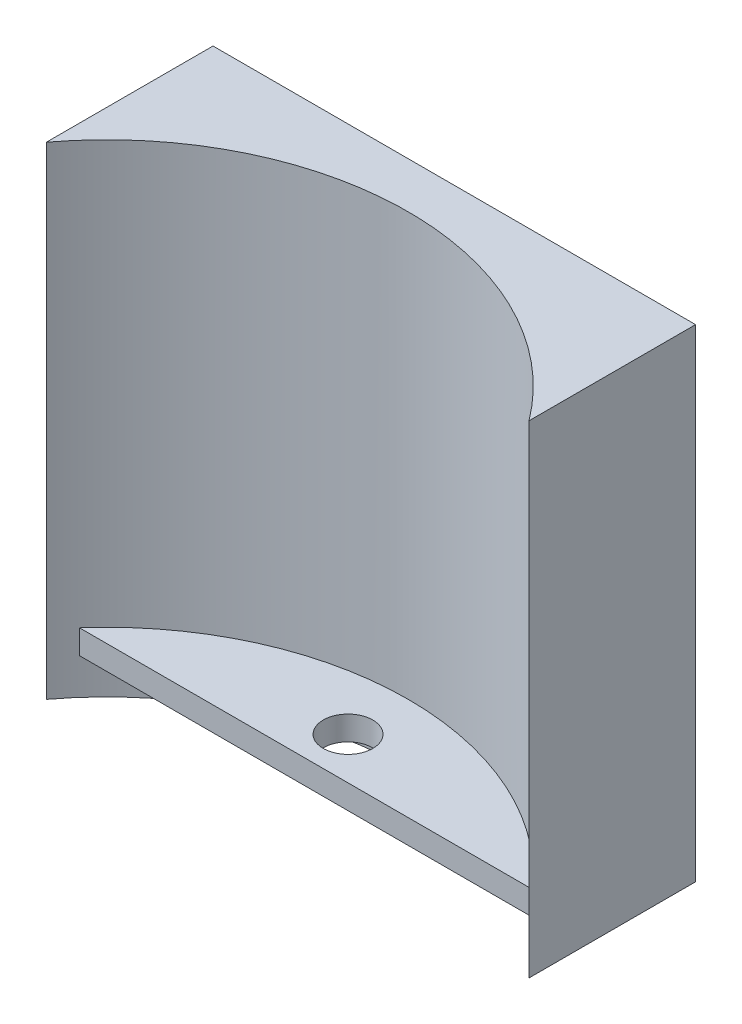
ISO-10303-21;
HEADER;
FILE_DESCRIPTION(('STEP AP214'),'2;1');
FILE_NAME('part.step','',(''),(''),'','','');
FILE_SCHEMA(('AUTOMOTIVE_DESIGN { 1 0 10303 214 1 1 1 1 }'));
ENDSEC;
DATA;
#1=APPLICATION_CONTEXT('core data for automotive mechanical design processes');
#2=APPLICATION_PROTOCOL_DEFINITION('international standard','automotive_design',2000,#1);
#3=PRODUCT_CONTEXT('',#1,'mechanical');
#4=PRODUCT('Part','Part','',(#3));
#5=PRODUCT_RELATED_PRODUCT_CATEGORY('part','',(#4));
#6=PRODUCT_DEFINITION_FORMATION('','',#4);
#7=PRODUCT_DEFINITION_CONTEXT('part definition',#1,'design');
#8=PRODUCT_DEFINITION('design','',#6,#7);
#9=PRODUCT_DEFINITION_SHAPE('','',#8);
#10=(LENGTH_UNIT() NAMED_UNIT(*) SI_UNIT(.MILLI.,.METRE.));
#11=(NAMED_UNIT(*) PLANE_ANGLE_UNIT() SI_UNIT($,.RADIAN.));
#12=(NAMED_UNIT(*) SI_UNIT($,.STERADIAN.) SOLID_ANGLE_UNIT());
#13=UNCERTAINTY_MEASURE_WITH_UNIT(LENGTH_MEASURE(1.E-05),#10,'distance_accuracy_value','');
#14=(GEOMETRIC_REPRESENTATION_CONTEXT(3) GLOBAL_UNCERTAINTY_ASSIGNED_CONTEXT((#13)) GLOBAL_UNIT_ASSIGNED_CONTEXT((#10,
#11,#12)) REPRESENTATION_CONTEXT('',''));
#15=CARTESIAN_POINT('',(0.,0.,0.));
#16=DIRECTION('',(0.,0.,1.));
#17=DIRECTION('',(1.,0.,0.));
#18=AXIS2_PLACEMENT_3D('',#15,#16,#17);
#19=CARTESIAN_POINT('',(20.,40.,-28.8090174170285));
#20=DIRECTION('',(-1.,0.,0.));
#21=DIRECTION('',(0.,0.,1.));
#22=AXIS2_PLACEMENT_3D('',#19,#20,#21);
#23=PLANE('',#22);
#24=DIRECTION('',(0.,0.,-1.));
#25=VECTOR('',#24,1.);
#26=CARTESIAN_POINT('',(20.,0.,-28.8090174170285));
#27=LINE('',#26,#25);
#28=CARTESIAN_POINT('',(20.,0.,-15.));
#29=VERTEX_POINT('',#28);
#30=CARTESIAN_POINT('',(20.,0.,-28.8090174170285));
#31=VERTEX_POINT('',#30);
#32=EDGE_CURVE('E109',#29,#31,#27,.T.);
#33=ORIENTED_EDGE('',*,*,#32,.T.);
#34=DIRECTION('',(0.,-1.,0.));
#35=VECTOR('',#34,1.);
#36=CARTESIAN_POINT('',(20.,40.,-28.8090174170285));
#37=LINE('',#36,#35);
#38=CARTESIAN_POINT('',(20.,40.,-28.8090174170285));
#39=VERTEX_POINT('',#38);
#40=EDGE_CURVE('E101',#39,#31,#37,.T.);
#41=ORIENTED_EDGE('',*,*,#40,.F.);
#42=DIRECTION('',(0.,0.,-1.));
#43=VECTOR('',#42,1.);
#44=CARTESIAN_POINT('',(20.,40.,-28.8090174170285));
#45=LINE('',#44,#43);
#46=CARTESIAN_POINT('',(20.,40.,-15.));
#47=VERTEX_POINT('',#46);
#48=EDGE_CURVE('E115',#47,#39,#45,.T.);
#49=ORIENTED_EDGE('',*,*,#48,.F.);
#50=DIRECTION('',(0.,-1.,0.));
#51=VECTOR('',#50,1.);
#52=CARTESIAN_POINT('',(20.,40.,-15.));
#53=LINE('',#52,#51);
#54=EDGE_CURVE('E129',#47,#29,#53,.T.);
#55=ORIENTED_EDGE('',*,*,#54,.T.);
#56=EDGE_LOOP('',(#33,#41,#49,#55));
#57=FACE_BOUND('',#56,.T.);
#58=ADVANCED_FACE('F39',(#57),#23,.F.);
#59=CARTESIAN_POINT('',(20.,40.,-28.8090174170285));
#60=DIRECTION('',(0.,0.,1.));
#61=DIRECTION('',(1.,0.,0.));
#62=AXIS2_PLACEMENT_3D('',#59,#60,#61);
#63=PLANE('',#62);
#64=DIRECTION('',(-1.,0.,0.));
#65=VECTOR('',#64,1.);
#66=CARTESIAN_POINT('',(20.,0.,-28.8090174170285));
#67=LINE('',#66,#65);
#68=CARTESIAN_POINT('',(-20.,0.,-28.8090174170285));
#69=VERTEX_POINT('',#68);
#70=EDGE_CURVE('E133',#31,#69,#67,.T.);
#71=ORIENTED_EDGE('',*,*,#70,.T.);
#72=DIRECTION('',(0.,-1.,0.));
#73=VECTOR('',#72,1.);
#74=CARTESIAN_POINT('',(-20.,40.,-28.8090174170285));
#75=LINE('',#74,#73);
#76=CARTESIAN_POINT('',(-20.,40.,-28.8090174170285));
#77=VERTEX_POINT('',#76);
#78=EDGE_CURVE('E148',#77,#69,#75,.T.);
#79=ORIENTED_EDGE('',*,*,#78,.F.);
#80=DIRECTION('',(-1.,0.,0.));
#81=VECTOR('',#80,1.);
#82=CARTESIAN_POINT('',(20.,40.,-28.8090174170285));
#83=LINE('',#82,#81);
#84=EDGE_CURVE('E119',#39,#77,#83,.T.);
#85=ORIENTED_EDGE('',*,*,#84,.F.);
#86=ORIENTED_EDGE('',*,*,#40,.T.);
#87=EDGE_LOOP('',(#71,#79,#85,#86));
#88=FACE_BOUND('',#87,.T.);
#89=ADVANCED_FACE('F158',(#88),#63,.F.);
#90=CARTESIAN_POINT('',(-20.,40.,-28.8090174170285));
#91=DIRECTION('',(1.,0.,0.));
#92=DIRECTION('',(0.,0.,-1.));
#93=AXIS2_PLACEMENT_3D('',#90,#91,#92);
#94=PLANE('',#93);
#95=DIRECTION('',(0.,0.,1.));
#96=VECTOR('',#95,1.);
#97=CARTESIAN_POINT('',(-20.,0.,-28.8090174170285));
#98=LINE('',#97,#96);
#99=CARTESIAN_POINT('',(-20.,0.,-15.));
#100=VERTEX_POINT('',#99);
#101=EDGE_CURVE('E136',#69,#100,#98,.T.);
#102=ORIENTED_EDGE('',*,*,#101,.T.);
#103=DIRECTION('',(0.,-1.,0.));
#104=VECTOR('',#103,1.);
#105=CARTESIAN_POINT('',(-20.,40.,-15.));
#106=LINE('',#105,#104);
#107=CARTESIAN_POINT('',(-20.,40.,-15.));
#108=VERTEX_POINT('',#107);
#109=EDGE_CURVE('E144',#108,#100,#106,.T.);
#110=ORIENTED_EDGE('',*,*,#109,.F.);
#111=DIRECTION('',(0.,0.,1.));
#112=VECTOR('',#111,1.);
#113=CARTESIAN_POINT('',(-20.,40.,-28.8090174170285));
#114=LINE('',#113,#112);
#115=EDGE_CURVE('E123',#77,#108,#114,.T.);
#116=ORIENTED_EDGE('',*,*,#115,.F.);
#117=ORIENTED_EDGE('',*,*,#78,.T.);
#118=EDGE_LOOP('',(#102,#110,#116,#117));
#119=FACE_BOUND('',#118,.T.);
#120=ADVANCED_FACE('F170',(#119),#94,.F.);
#121=CARTESIAN_POINT('',(0.,40.,0.));
#122=DIRECTION('',(0.,-1.,0.));
#123=DIRECTION('',(0.,0.,-1.));
#124=AXIS2_PLACEMENT_3D('',#121,#122,#123);
#125=CYLINDRICAL_SURFACE('',#124,25.);
#126=DIRECTION('',(0.,-1.,0.));
#127=VECTOR('',#126,1.);
#128=CARTESIAN_POINT('',(18.7738515519709,40.,-16.5088611934487));
#129=LINE('',#128,#127);
#130=CARTESIAN_POINT('',(18.7738515519709,3.,-16.5088611934487));
#131=VERTEX_POINT('',#130);
#132=CARTESIAN_POINT('',(18.7738515519709,5.,-16.5088611934487));
#133=VERTEX_POINT('',#132);
#134=EDGE_CURVE('E48',#131,#133,#129,.F.);
#135=ORIENTED_EDGE('',*,*,#134,.F.);
#136=CARTESIAN_POINT('',(0.,3.,0.));
#137=DIRECTION('',(0.,-1.,0.));
#138=DIRECTION('',(0.,0.,-1.));
#139=AXIS2_PLACEMENT_3D('',#136,#137,#138);
#140=CIRCLE('',#139,25.);
#141=CARTESIAN_POINT('',(-18.7738515519709,3.,-16.5088611934488));
#142=VERTEX_POINT('',#141);
#143=EDGE_CURVE('E11',#131,#142,#140,.F.);
#144=ORIENTED_EDGE('',*,*,#143,.T.);
#145=DIRECTION('',(0.,-1.,0.));
#146=VECTOR('',#145,1.);
#147=CARTESIAN_POINT('',(-18.7738515519709,40.,-16.5088611934488));
#148=LINE('',#147,#146);
#149=CARTESIAN_POINT('',(-18.7738515519709,5.,-16.5088611934488));
#150=VERTEX_POINT('',#149);
#151=EDGE_CURVE('E85',#150,#142,#148,.T.);
#152=ORIENTED_EDGE('',*,*,#151,.F.);
#153=CARTESIAN_POINT('',(0.,5.,0.));
#154=DIRECTION('',(0.,-1.,0.));
#155=DIRECTION('',(0.,0.,-1.));
#156=AXIS2_PLACEMENT_3D('',#153,#154,#155);
#157=CIRCLE('',#156,25.);
#158=EDGE_CURVE('E89',#133,#150,#157,.F.);
#159=ORIENTED_EDGE('',*,*,#158,.F.);
#160=EDGE_LOOP('',(#135,#144,#152,#159));
#161=FACE_BOUND('',#160,.T.);
#162=CARTESIAN_POINT('',(0.,0.,0.));
#163=DIRECTION('',(0.,-1.,0.));
#164=DIRECTION('',(0.,0.,1.));
#165=AXIS2_PLACEMENT_3D('',#162,#163,#164);
#166=CIRCLE('',#165,25.);
#167=EDGE_CURVE('E120',#100,#29,#166,.T.);
#168=ORIENTED_EDGE('',*,*,#167,.T.);
#169=ORIENTED_EDGE('',*,*,#54,.F.);
#170=CARTESIAN_POINT('',(0.,40.,0.));
#171=DIRECTION('',(0.,-1.,0.));
#172=DIRECTION('',(0.,0.,1.));
#173=AXIS2_PLACEMENT_3D('',#170,#171,#172);
#174=CIRCLE('',#173,25.);
#175=EDGE_CURVE('E126',#108,#47,#174,.T.);
#176=ORIENTED_EDGE('',*,*,#175,.F.);
#177=ORIENTED_EDGE('',*,*,#109,.T.);
#178=EDGE_LOOP('',(#168,#169,#176,#177));
#179=FACE_BOUND('',#178,.T.);
#180=ADVANCED_FACE('F87',(#161,#179),#125,.F.);
#181=CARTESIAN_POINT('',(0.,40.,0.));
#182=DIRECTION('',(0.,1.,0.));
#183=DIRECTION('',(0.,0.,1.));
#184=AXIS2_PLACEMENT_3D('',#181,#182,#183);
#185=PLANE('',#184);
#186=ORIENTED_EDGE('',*,*,#48,.T.);
#187=ORIENTED_EDGE('',*,*,#84,.T.);
#188=ORIENTED_EDGE('',*,*,#115,.T.);
#189=ORIENTED_EDGE('',*,*,#175,.T.);
#190=EDGE_LOOP('',(#186,#187,#188,#189));
#191=FACE_BOUND('',#190,.T.);
#192=ADVANCED_FACE('F174',(#191),#185,.T.);
#193=CARTESIAN_POINT('',(0.,0.,0.));
#194=DIRECTION('',(0.,1.,0.));
#195=DIRECTION('',(0.,0.,1.));
#196=AXIS2_PLACEMENT_3D('',#193,#194,#195);
#197=PLANE('',#196);
#198=ORIENTED_EDGE('',*,*,#32,.F.);
#199=ORIENTED_EDGE('',*,*,#167,.F.);
#200=ORIENTED_EDGE('',*,*,#101,.F.);
#201=ORIENTED_EDGE('',*,*,#70,.F.);
#202=EDGE_LOOP('',(#198,#199,#200,#201));
#203=FACE_BOUND('',#202,.T.);
#204=ADVANCED_FACE('F166',(#203),#197,.F.);
#205=CARTESIAN_POINT('',(-20.,3.,-16.5088611934488));
#206=DIRECTION('',(0.,0.,-1.));
#207=DIRECTION('',(-1.,0.,0.));
#208=AXIS2_PLACEMENT_3D('',#205,#206,#207);
#209=PLANE('',#208);
#210=DIRECTION('',(-1.,0.,0.));
#211=VECTOR('',#210,1.);
#212=CARTESIAN_POINT('',(-20.,3.,-16.5088611934488));
#213=LINE('',#212,#211);
#214=EDGE_CURVE('E105',#131,#142,#213,.T.);
#215=ORIENTED_EDGE('',*,*,#214,.F.);
#216=ORIENTED_EDGE('',*,*,#134,.T.);
#217=DIRECTION('',(-1.,0.,0.));
#218=VECTOR('',#217,1.);
#219=CARTESIAN_POINT('',(-20.,5.,-16.5088611934488));
#220=LINE('',#219,#218);
#221=EDGE_CURVE('E99',#133,#150,#220,.T.);
#222=ORIENTED_EDGE('',*,*,#221,.T.);
#223=ORIENTED_EDGE('',*,*,#151,.T.);
#224=EDGE_LOOP('',(#215,#216,#222,#223));
#225=FACE_BOUND('',#224,.T.);
#226=ADVANCED_FACE('F103',(#225),#209,.F.);
#227=CARTESIAN_POINT('',(0.,3.,0.));
#228=DIRECTION('',(0.,-1.,0.));
#229=DIRECTION('',(0.,0.,-1.));
#230=AXIS2_PLACEMENT_3D('',#227,#228,#229);
#231=PLANE('',#230);
#232=CARTESIAN_POINT('',(0.,3.,-20.));
#233=DIRECTION('',(0.,-1.,0.));
#234=DIRECTION('',(0.,0.,-1.));
#235=AXIS2_PLACEMENT_3D('',#232,#233,#234);
#236=CIRCLE('',#235,2.05);
#237=CARTESIAN_POINT('',(0.,3.,-22.05));
#238=VERTEX_POINT('',#237);
#239=EDGE_CURVE('E112',#238,#238,#236,.T.);
#240=ORIENTED_EDGE('',*,*,#239,.F.);
#241=EDGE_LOOP('',(#240));
#242=FACE_BOUND('',#241,.T.);
#243=ORIENTED_EDGE('',*,*,#143,.F.);
#244=ORIENTED_EDGE('',*,*,#214,.T.);
#245=EDGE_LOOP('',(#243,#244));
#246=FACE_BOUND('',#245,.T.);
#247=ADVANCED_FACE('F208',(#242,#246),#231,.T.);
#248=CARTESIAN_POINT('',(0.,5.,0.));
#249=DIRECTION('',(0.,-1.,0.));
#250=DIRECTION('',(0.,0.,-1.));
#251=AXIS2_PLACEMENT_3D('',#248,#249,#250);
#252=PLANE('',#251);
#253=CARTESIAN_POINT('',(0.,5.,-20.));
#254=DIRECTION('',(0.,-1.,0.));
#255=DIRECTION('',(0.,0.,-1.));
#256=AXIS2_PLACEMENT_3D('',#253,#254,#255);
#257=CIRCLE('',#256,2.05);
#258=CARTESIAN_POINT('',(0.,5.,-22.05));
#259=VERTEX_POINT('',#258);
#260=EDGE_CURVE('E42',#259,#259,#257,.T.);
#261=ORIENTED_EDGE('',*,*,#260,.T.);
#262=EDGE_LOOP('',(#261));
#263=FACE_BOUND('',#262,.T.);
#264=ORIENTED_EDGE('',*,*,#221,.F.);
#265=ORIENTED_EDGE('',*,*,#158,.T.);
#266=EDGE_LOOP('',(#264,#265));
#267=FACE_BOUND('',#266,.T.);
#268=ADVANCED_FACE('F98',(#263,#267),#252,.F.);
#269=CARTESIAN_POINT('',(0.,40.,-20.));
#270=DIRECTION('',(0.,-1.,0.));
#271=DIRECTION('',(0.,0.,-1.));
#272=AXIS2_PLACEMENT_3D('',#269,#270,#271);
#273=CYLINDRICAL_SURFACE('',#272,2.05);
#274=ORIENTED_EDGE('',*,*,#239,.T.);
#275=EDGE_LOOP('',(#274));
#276=FACE_BOUND('',#275,.T.);
#277=ORIENTED_EDGE('',*,*,#260,.F.);
#278=EDGE_LOOP('',(#277));
#279=FACE_BOUND('',#278,.T.);
#280=ADVANCED_FACE('F226',(#276,#279),#273,.F.);
#281=CLOSED_SHELL('',(#58,#89,#120,#180,#192,#204,#226,#247,#268,#280));
#282=MANIFOLD_SOLID_BREP('B2',#281);
#283=ADVANCED_BREP_SHAPE_REPRESENTATION('',(#18,#282),#14);
#284=SHAPE_DEFINITION_REPRESENTATION(#9,#283);
ENDSEC;
END-ISO-10303-21;
